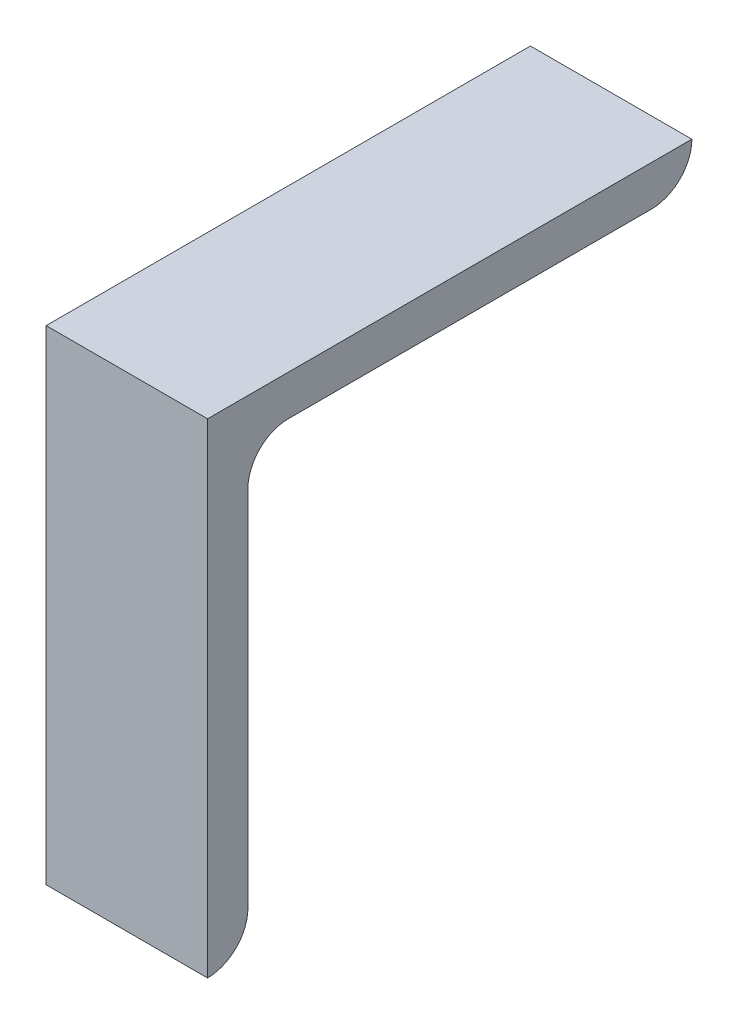
ISO-10303-21;
HEADER;
FILE_DESCRIPTION(('STEP AP214'),'2;1');
FILE_NAME('part.step','',(''),(''),'','','');
FILE_SCHEMA(('AUTOMOTIVE_DESIGN { 1 0 10303 214 1 1 1 1 }'));
ENDSEC;
DATA;
#1=APPLICATION_CONTEXT('core data for automotive mechanical design processes');
#2=APPLICATION_PROTOCOL_DEFINITION('international standard','automotive_design',2000,#1);
#3=PRODUCT_CONTEXT('',#1,'mechanical');
#4=PRODUCT('Part','Part','',(#3));
#5=PRODUCT_RELATED_PRODUCT_CATEGORY('part','',(#4));
#6=PRODUCT_DEFINITION_FORMATION('','',#4);
#7=PRODUCT_DEFINITION_CONTEXT('part definition',#1,'design');
#8=PRODUCT_DEFINITION('design','',#6,#7);
#9=PRODUCT_DEFINITION_SHAPE('','',#8);
#10=(LENGTH_UNIT() NAMED_UNIT(*) SI_UNIT(.MILLI.,.METRE.));
#11=(NAMED_UNIT(*) PLANE_ANGLE_UNIT() SI_UNIT($,.RADIAN.));
#12=(NAMED_UNIT(*) SI_UNIT($,.STERADIAN.) SOLID_ANGLE_UNIT());
#13=UNCERTAINTY_MEASURE_WITH_UNIT(LENGTH_MEASURE(1.E-05),#10,'distance_accuracy_value','');
#14=(GEOMETRIC_REPRESENTATION_CONTEXT(3) GLOBAL_UNCERTAINTY_ASSIGNED_CONTEXT((#13)) GLOBAL_UNIT_ASSIGNED_CONTEXT((#10,
#11,#12)) REPRESENTATION_CONTEXT('',''));
#15=CARTESIAN_POINT('',(0.,0.,0.));
#16=DIRECTION('',(0.,0.,1.));
#17=DIRECTION('',(1.,0.,0.));
#18=AXIS2_PLACEMENT_3D('',#15,#16,#17);
#19=CARTESIAN_POINT('',(45.81144,0.,-69.85));
#20=DIRECTION('',(-1.,0.,0.));
#21=DIRECTION('',(0.,0.,1.));
#22=AXIS2_PLACEMENT_3D('',#19,#20,#21);
#23=CYLINDRICAL_SURFACE('',#22,6.35);
#24=DIRECTION('',(1.,0.,0.));
#25=VECTOR('',#24,1.);
#26=CARTESIAN_POINT('',(-12.7,-6.35,-69.85));
#27=LINE('',#26,#25);
#28=CARTESIAN_POINT('',(-12.7,-6.35,-69.85));
#29=VERTEX_POINT('',#28);
#30=CARTESIAN_POINT('',(12.7,-6.35,-69.85));
#31=VERTEX_POINT('',#30);
#32=EDGE_CURVE('E87',#29,#31,#27,.T.);
#33=ORIENTED_EDGE('',*,*,#32,.F.);
#34=CARTESIAN_POINT('',(-12.7,0.,-69.85));
#35=DIRECTION('',(-1.,0.,0.));
#36=DIRECTION('',(0.,0.,1.));
#37=AXIS2_PLACEMENT_3D('',#34,#35,#36);
#38=CIRCLE('',#37,6.35);
#39=CARTESIAN_POINT('',(-12.7,0.,-76.2));
#40=VERTEX_POINT('',#39);
#41=EDGE_CURVE('E112',#29,#40,#38,.F.);
#42=ORIENTED_EDGE('',*,*,#41,.T.);
#43=DIRECTION('',(1.,0.,0.));
#44=VECTOR('',#43,1.);
#45=CARTESIAN_POINT('',(-12.7,0.,-76.2));
#46=LINE('',#45,#44);
#47=CARTESIAN_POINT('',(12.7,0.,-76.2));
#48=VERTEX_POINT('',#47);
#49=EDGE_CURVE('E109',#48,#40,#46,.F.);
#50=ORIENTED_EDGE('',*,*,#49,.F.);
#51=CARTESIAN_POINT('',(12.7,0.,-69.85));
#52=DIRECTION('',(-1.,0.,0.));
#53=DIRECTION('',(0.,0.,1.));
#54=AXIS2_PLACEMENT_3D('',#51,#52,#53);
#55=CIRCLE('',#54,6.35);
#56=EDGE_CURVE('E94',#31,#48,#55,.F.);
#57=ORIENTED_EDGE('',*,*,#56,.F.);
#58=EDGE_LOOP('',(#33,#42,#50,#57));
#59=FACE_BOUND('',#58,.T.);
#60=ADVANCED_FACE('F17',(#59),#23,.T.);
#61=CARTESIAN_POINT('',(-45.81144,-12.7,-12.7));
#62=DIRECTION('',(1.,0.,0.));
#63=DIRECTION('',(0.,0.,-1.));
#64=AXIS2_PLACEMENT_3D('',#61,#62,#63);
#65=CYLINDRICAL_SURFACE('',#64,6.35);
#66=DIRECTION('',(-1.,0.,0.));
#67=VECTOR('',#66,1.);
#68=CARTESIAN_POINT('',(-12.7,-12.7,-6.35));
#69=LINE('',#68,#67);
#70=CARTESIAN_POINT('',(-12.7,-12.7,-6.35));
#71=VERTEX_POINT('',#70);
#72=CARTESIAN_POINT('',(12.7,-12.7,-6.35));
#73=VERTEX_POINT('',#72);
#74=EDGE_CURVE('E72',#71,#73,#69,.F.);
#75=ORIENTED_EDGE('',*,*,#74,.F.);
#76=CARTESIAN_POINT('',(-12.7,-12.7,-12.7));
#77=DIRECTION('',(1.,0.,0.));
#78=DIRECTION('',(0.,0.,-1.));
#79=AXIS2_PLACEMENT_3D('',#76,#77,#78);
#80=CIRCLE('',#79,6.35);
#81=CARTESIAN_POINT('',(-12.7,-6.35,-12.7));
#82=VERTEX_POINT('',#81);
#83=EDGE_CURVE('E83',#71,#82,#80,.F.);
#84=ORIENTED_EDGE('',*,*,#83,.T.);
#85=DIRECTION('',(1.,0.,0.));
#86=VECTOR('',#85,1.);
#87=CARTESIAN_POINT('',(-12.7,-6.35,-12.7));
#88=LINE('',#87,#86);
#89=CARTESIAN_POINT('',(12.7,-6.35,-12.7));
#90=VERTEX_POINT('',#89);
#91=EDGE_CURVE('E77',#90,#82,#88,.F.);
#92=ORIENTED_EDGE('',*,*,#91,.F.);
#93=CARTESIAN_POINT('',(12.7,-12.7,-12.7));
#94=DIRECTION('',(1.,0.,0.));
#95=DIRECTION('',(0.,0.,-1.));
#96=AXIS2_PLACEMENT_3D('',#93,#94,#95);
#97=CIRCLE('',#96,6.35);
#98=EDGE_CURVE('E20',#73,#90,#97,.F.);
#99=ORIENTED_EDGE('',*,*,#98,.F.);
#100=EDGE_LOOP('',(#75,#84,#92,#99));
#101=FACE_BOUND('',#100,.T.);
#102=ADVANCED_FACE('F79',(#101),#65,.F.);
#103=CARTESIAN_POINT('',(-12.7,-6.35,-6.35));
#104=DIRECTION('',(0.,-1.,0.));
#105=DIRECTION('',(0.,0.,-1.));
#106=AXIS2_PLACEMENT_3D('',#103,#104,#105);
#107=PLANE('',#106);
#108=DIRECTION('',(0.,0.,-1.));
#109=VECTOR('',#108,1.);
#110=CARTESIAN_POINT('',(-12.7,-6.35,0.));
#111=LINE('',#110,#109);
#112=EDGE_CURVE('E106',#82,#29,#111,.T.);
#113=ORIENTED_EDGE('',*,*,#112,.T.);
#114=ORIENTED_EDGE('',*,*,#32,.T.);
#115=DIRECTION('',(0.,0.,-1.));
#116=VECTOR('',#115,1.);
#117=CARTESIAN_POINT('',(12.7,-6.35,0.));
#118=LINE('',#117,#116);
#119=EDGE_CURVE('E90',#90,#31,#118,.T.);
#120=ORIENTED_EDGE('',*,*,#119,.F.);
#121=ORIENTED_EDGE('',*,*,#91,.T.);
#122=EDGE_LOOP('',(#113,#114,#120,#121));
#123=FACE_BOUND('',#122,.T.);
#124=ADVANCED_FACE('F91',(#123),#107,.T.);
#125=CARTESIAN_POINT('',(-12.7,-76.2,-6.35));
#126=DIRECTION('',(0.,0.,-1.));
#127=DIRECTION('',(-1.,0.,0.));
#128=AXIS2_PLACEMENT_3D('',#125,#126,#127);
#129=PLANE('',#128);
#130=DIRECTION('',(0.,1.,0.));
#131=VECTOR('',#130,1.);
#132=CARTESIAN_POINT('',(12.7,0.,-6.35));
#133=LINE('',#132,#131);
#134=CARTESIAN_POINT('',(12.7,-69.85,-6.35));
#135=VERTEX_POINT('',#134);
#136=EDGE_CURVE('E98',#135,#73,#133,.T.);
#137=ORIENTED_EDGE('',*,*,#136,.F.);
#138=DIRECTION('',(-1.,0.,0.));
#139=VECTOR('',#138,1.);
#140=CARTESIAN_POINT('',(45.81144,-69.85,-6.35));
#141=LINE('',#140,#139);
#142=CARTESIAN_POINT('',(-12.7,-69.85,-6.35));
#143=VERTEX_POINT('',#142);
#144=EDGE_CURVE('E103',#143,#135,#141,.F.);
#145=ORIENTED_EDGE('',*,*,#144,.F.);
#146=DIRECTION('',(0.,1.,0.));
#147=VECTOR('',#146,1.);
#148=CARTESIAN_POINT('',(-12.7,0.,-6.35));
#149=LINE('',#148,#147);
#150=EDGE_CURVE('E119',#143,#71,#149,.T.);
#151=ORIENTED_EDGE('',*,*,#150,.T.);
#152=ORIENTED_EDGE('',*,*,#74,.T.);
#153=EDGE_LOOP('',(#137,#145,#151,#152));
#154=FACE_BOUND('',#153,.T.);
#155=ADVANCED_FACE('F155',(#154),#129,.T.);
#156=CARTESIAN_POINT('',(12.7,0.,0.));
#157=DIRECTION('',(1.,0.,0.));
#158=DIRECTION('',(0.,0.,-1.));
#159=AXIS2_PLACEMENT_3D('',#156,#157,#158);
#160=PLANE('',#159);
#161=ORIENTED_EDGE('',*,*,#119,.T.);
#162=ORIENTED_EDGE('',*,*,#56,.T.);
#163=DIRECTION('',(0.,0.,1.));
#164=VECTOR('',#163,1.);
#165=CARTESIAN_POINT('',(12.7,0.,-76.2));
#166=LINE('',#165,#164);
#167=CARTESIAN_POINT('',(12.7,0.,0.));
#168=VERTEX_POINT('',#167);
#169=EDGE_CURVE('E113',#168,#48,#166,.F.);
#170=ORIENTED_EDGE('',*,*,#169,.F.);
#171=DIRECTION('',(0.,1.,0.));
#172=VECTOR('',#171,1.);
#173=CARTESIAN_POINT('',(12.7,0.,0.));
#174=LINE('',#173,#172);
#175=CARTESIAN_POINT('',(12.7,-76.2,0.));
#176=VERTEX_POINT('',#175);
#177=EDGE_CURVE('E115',#176,#168,#174,.T.);
#178=ORIENTED_EDGE('',*,*,#177,.F.);
#179=CARTESIAN_POINT('',(12.7,-69.85,0.));
#180=DIRECTION('',(-1.,0.,0.));
#181=DIRECTION('',(0.,0.,1.));
#182=AXIS2_PLACEMENT_3D('',#179,#180,#181);
#183=CIRCLE('',#182,6.35);
#184=EDGE_CURVE('E105',#135,#176,#183,.T.);
#185=ORIENTED_EDGE('',*,*,#184,.F.);
#186=ORIENTED_EDGE('',*,*,#136,.T.);
#187=ORIENTED_EDGE('',*,*,#98,.T.);
#188=EDGE_LOOP('',(#161,#162,#170,#178,#185,#186,#187));
#189=FACE_BOUND('',#188,.T.);
#190=ADVANCED_FACE('F96',(#189),#160,.T.);
#191=CARTESIAN_POINT('',(-12.7,0.,-76.2));
#192=DIRECTION('',(0.,1.,0.));
#193=DIRECTION('',(0.,0.,1.));
#194=AXIS2_PLACEMENT_3D('',#191,#192,#193);
#195=PLANE('',#194);
#196=ORIENTED_EDGE('',*,*,#169,.T.);
#197=ORIENTED_EDGE('',*,*,#49,.T.);
#198=DIRECTION('',(0.,0.,-1.));
#199=VECTOR('',#198,1.);
#200=CARTESIAN_POINT('',(-12.7,0.,0.));
#201=LINE('',#200,#199);
#202=CARTESIAN_POINT('',(-12.7,0.,0.));
#203=VERTEX_POINT('',#202);
#204=EDGE_CURVE('E120',#40,#203,#201,.F.);
#205=ORIENTED_EDGE('',*,*,#204,.T.);
#206=DIRECTION('',(1.,0.,0.));
#207=VECTOR('',#206,1.);
#208=CARTESIAN_POINT('',(-12.7,0.,0.));
#209=LINE('',#208,#207);
#210=EDGE_CURVE('E134',#168,#203,#209,.F.);
#211=ORIENTED_EDGE('',*,*,#210,.F.);
#212=EDGE_LOOP('',(#196,#197,#205,#211));
#213=FACE_BOUND('',#212,.T.);
#214=ADVANCED_FACE('F151',(#213),#195,.T.);
#215=CARTESIAN_POINT('',(-12.7,0.,0.));
#216=DIRECTION('',(1.,0.,0.));
#217=DIRECTION('',(0.,0.,-1.));
#218=AXIS2_PLACEMENT_3D('',#215,#216,#217);
#219=PLANE('',#218);
#220=ORIENTED_EDGE('',*,*,#83,.F.);
#221=ORIENTED_EDGE('',*,*,#150,.F.);
#222=CARTESIAN_POINT('',(-12.7,-69.85,0.));
#223=DIRECTION('',(-1.,0.,0.));
#224=DIRECTION('',(0.,0.,1.));
#225=AXIS2_PLACEMENT_3D('',#222,#223,#224);
#226=CIRCLE('',#225,6.35);
#227=CARTESIAN_POINT('',(-12.7,-76.2,0.));
#228=VERTEX_POINT('',#227);
#229=EDGE_CURVE('E35',#228,#143,#226,.F.);
#230=ORIENTED_EDGE('',*,*,#229,.F.);
#231=DIRECTION('',(0.,1.,0.));
#232=VECTOR('',#231,1.);
#233=CARTESIAN_POINT('',(-12.7,0.,0.));
#234=LINE('',#233,#232);
#235=EDGE_CURVE('E26',#203,#228,#234,.F.);
#236=ORIENTED_EDGE('',*,*,#235,.F.);
#237=ORIENTED_EDGE('',*,*,#204,.F.);
#238=ORIENTED_EDGE('',*,*,#41,.F.);
#239=ORIENTED_EDGE('',*,*,#112,.F.);
#240=EDGE_LOOP('',(#220,#221,#230,#236,#237,#238,#239));
#241=FACE_BOUND('',#240,.T.);
#242=ADVANCED_FACE('F149',(#241),#219,.F.);
#243=CARTESIAN_POINT('',(45.81144,-69.85,0.));
#244=DIRECTION('',(-1.,0.,0.));
#245=DIRECTION('',(0.,0.,1.));
#246=AXIS2_PLACEMENT_3D('',#243,#244,#245);
#247=CYLINDRICAL_SURFACE('',#246,6.35);
#248=DIRECTION('',(1.,0.,0.));
#249=VECTOR('',#248,1.);
#250=CARTESIAN_POINT('',(-12.7,-76.2,0.));
#251=LINE('',#250,#249);
#252=EDGE_CURVE('E11',#228,#176,#251,.T.);
#253=ORIENTED_EDGE('',*,*,#252,.F.);
#254=ORIENTED_EDGE('',*,*,#229,.T.);
#255=ORIENTED_EDGE('',*,*,#144,.T.);
#256=ORIENTED_EDGE('',*,*,#184,.T.);
#257=EDGE_LOOP('',(#253,#254,#255,#256));
#258=FACE_BOUND('',#257,.T.);
#259=ADVANCED_FACE('F154',(#258),#247,.T.);
#260=CARTESIAN_POINT('',(-12.7,0.,0.));
#261=DIRECTION('',(0.,0.,1.));
#262=DIRECTION('',(1.,0.,0.));
#263=AXIS2_PLACEMENT_3D('',#260,#261,#262);
#264=PLANE('',#263);
#265=ORIENTED_EDGE('',*,*,#235,.T.);
#266=ORIENTED_EDGE('',*,*,#252,.T.);
#267=ORIENTED_EDGE('',*,*,#177,.T.);
#268=ORIENTED_EDGE('',*,*,#210,.T.);
#269=EDGE_LOOP('',(#265,#266,#267,#268));
#270=FACE_BOUND('',#269,.T.);
#271=ADVANCED_FACE('F152',(#270),#264,.T.);
#272=CLOSED_SHELL('',(#60,#102,#124,#155,#190,#214,#242,#259,#271));
#273=MANIFOLD_SOLID_BREP('B1',#272);
#274=ADVANCED_BREP_SHAPE_REPRESENTATION('',(#18,#273),#14);
#275=SHAPE_DEFINITION_REPRESENTATION(#9,#274);
ENDSEC;
END-ISO-10303-21;
